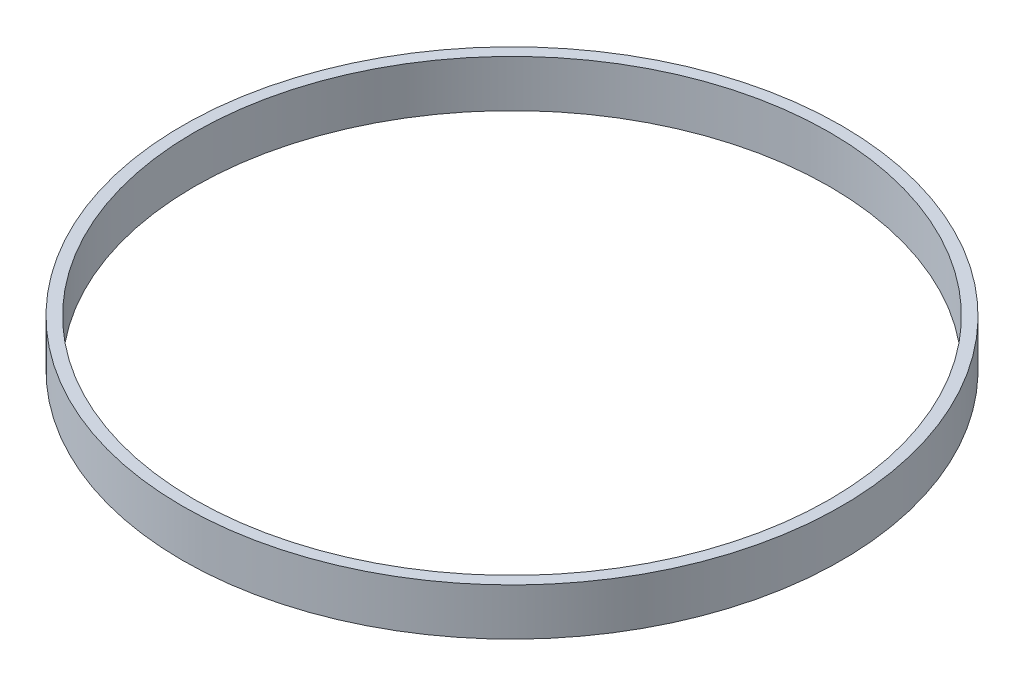
ISO-10303-21;
HEADER;
FILE_DESCRIPTION(('STEP AP214'),'2;1');
FILE_NAME('part.step','',(''),(''),'','','');
FILE_SCHEMA(('AUTOMOTIVE_DESIGN { 1 0 10303 214 1 1 1 1 }'));
ENDSEC;
DATA;
#1=APPLICATION_CONTEXT('core data for automotive mechanical design processes');
#2=APPLICATION_PROTOCOL_DEFINITION('international standard','automotive_design',2000,#1);
#3=PRODUCT_CONTEXT('',#1,'mechanical');
#4=PRODUCT('Part','Part','',(#3));
#5=PRODUCT_RELATED_PRODUCT_CATEGORY('part','',(#4));
#6=PRODUCT_DEFINITION_FORMATION('','',#4);
#7=PRODUCT_DEFINITION_CONTEXT('part definition',#1,'design');
#8=PRODUCT_DEFINITION('design','',#6,#7);
#9=PRODUCT_DEFINITION_SHAPE('','',#8);
#10=(LENGTH_UNIT() NAMED_UNIT(*) SI_UNIT(.MILLI.,.METRE.));
#11=(NAMED_UNIT(*) PLANE_ANGLE_UNIT() SI_UNIT($,.RADIAN.));
#12=(NAMED_UNIT(*) SI_UNIT($,.STERADIAN.) SOLID_ANGLE_UNIT());
#13=UNCERTAINTY_MEASURE_WITH_UNIT(LENGTH_MEASURE(1.E-05),#10,'distance_accuracy_value','');
#14=(GEOMETRIC_REPRESENTATION_CONTEXT(3) GLOBAL_UNCERTAINTY_ASSIGNED_CONTEXT((#13)) GLOBAL_UNIT_ASSIGNED_CONTEXT((#10,
#11,#12)) REPRESENTATION_CONTEXT('',''));
#15=CARTESIAN_POINT('',(0.,0.,0.));
#16=DIRECTION('',(0.,0.,1.));
#17=DIRECTION('',(1.,0.,0.));
#18=AXIS2_PLACEMENT_3D('',#15,#16,#17);
#19=CARTESIAN_POINT('',(0.,6.35,0.));
#20=DIRECTION('',(0.,1.,0.));
#21=DIRECTION('',(0.,0.,1.));
#22=AXIS2_PLACEMENT_3D('',#19,#20,#21);
#23=PLANE('',#22);
#24=CARTESIAN_POINT('',(0.,6.35,0.));
#25=DIRECTION('',(0.,1.,0.));
#26=DIRECTION('',(0.,0.,1.));
#27=AXIS2_PLACEMENT_3D('',#24,#25,#26);
#28=CIRCLE('',#27,89.1286);
#29=CARTESIAN_POINT('',(0.,6.35,89.1286));
#30=VERTEX_POINT('',#29);
#31=EDGE_CURVE('E10',#30,#30,#28,.T.);
#32=ORIENTED_EDGE('',*,*,#31,.T.);
#33=EDGE_LOOP('',(#32));
#34=FACE_BOUND('',#33,.T.);
#35=CARTESIAN_POINT('',(0.,6.35,0.));
#36=DIRECTION('',(0.,1.,0.));
#37=DIRECTION('',(0.,0.,1.));
#38=AXIS2_PLACEMENT_3D('',#35,#36,#37);
#39=CIRCLE('',#38,85.9536);
#40=CARTESIAN_POINT('',(0.,6.35,85.9536));
#41=VERTEX_POINT('',#40);
#42=EDGE_CURVE('E53',#41,#41,#39,.T.);
#43=ORIENTED_EDGE('',*,*,#42,.F.);
#44=EDGE_LOOP('',(#43));
#45=FACE_BOUND('',#44,.T.);
#46=ADVANCED_FACE('F39',(#34,#45),#23,.T.);
#47=CARTESIAN_POINT('',(0.,-6.35,0.));
#48=DIRECTION('',(0.,1.,0.));
#49=DIRECTION('',(0.,0.,1.));
#50=AXIS2_PLACEMENT_3D('',#47,#48,#49);
#51=PLANE('',#50);
#52=CARTESIAN_POINT('',(0.,-6.35,0.));
#53=DIRECTION('',(0.,1.,0.));
#54=DIRECTION('',(0.,0.,1.));
#55=AXIS2_PLACEMENT_3D('',#52,#53,#54);
#56=CIRCLE('',#55,89.1286);
#57=CARTESIAN_POINT('',(0.,-6.35,89.1286));
#58=VERTEX_POINT('',#57);
#59=EDGE_CURVE('E43',#58,#58,#56,.T.);
#60=ORIENTED_EDGE('',*,*,#59,.F.);
#61=EDGE_LOOP('',(#60));
#62=FACE_BOUND('',#61,.T.);
#63=CARTESIAN_POINT('',(0.,-6.35,0.));
#64=DIRECTION('',(0.,1.,0.));
#65=DIRECTION('',(0.,0.,1.));
#66=AXIS2_PLACEMENT_3D('',#63,#64,#65);
#67=CIRCLE('',#66,85.9536);
#68=CARTESIAN_POINT('',(0.,-6.35,85.9536));
#69=VERTEX_POINT('',#68);
#70=EDGE_CURVE('E55',#69,#69,#67,.T.);
#71=ORIENTED_EDGE('',*,*,#70,.T.);
#72=EDGE_LOOP('',(#71));
#73=FACE_BOUND('',#72,.T.);
#74=ADVANCED_FACE('F66',(#62,#73),#51,.F.);
#75=CARTESIAN_POINT('',(0.,6.35,0.));
#76=DIRECTION('',(0.,-1.,0.));
#77=DIRECTION('',(0.,0.,-1.));
#78=AXIS2_PLACEMENT_3D('',#75,#76,#77);
#79=CYLINDRICAL_SURFACE('',#78,89.1286);
#80=ORIENTED_EDGE('',*,*,#31,.F.);
#81=EDGE_LOOP('',(#80));
#82=FACE_BOUND('',#81,.T.);
#83=ORIENTED_EDGE('',*,*,#59,.T.);
#84=EDGE_LOOP('',(#83));
#85=FACE_BOUND('',#84,.T.);
#86=ADVANCED_FACE('F41',(#82,#85),#79,.T.);
#87=CARTESIAN_POINT('',(0.,6.35,0.));
#88=DIRECTION('',(0.,-1.,0.));
#89=DIRECTION('',(0.,0.,-1.));
#90=AXIS2_PLACEMENT_3D('',#87,#88,#89);
#91=CYLINDRICAL_SURFACE('',#90,85.9536);
#92=ORIENTED_EDGE('',*,*,#42,.T.);
#93=EDGE_LOOP('',(#92));
#94=FACE_BOUND('',#93,.T.);
#95=ORIENTED_EDGE('',*,*,#70,.F.);
#96=EDGE_LOOP('',(#95));
#97=FACE_BOUND('',#96,.T.);
#98=ADVANCED_FACE('F62',(#94,#97),#91,.F.);
#99=CLOSED_SHELL('',(#46,#74,#86,#98));
#100=MANIFOLD_SOLID_BREP('B2',#99);
#101=ADVANCED_BREP_SHAPE_REPRESENTATION('',(#18,#100),#14);
#102=SHAPE_DEFINITION_REPRESENTATION(#9,#101);
ENDSEC;
END-ISO-10303-21;
